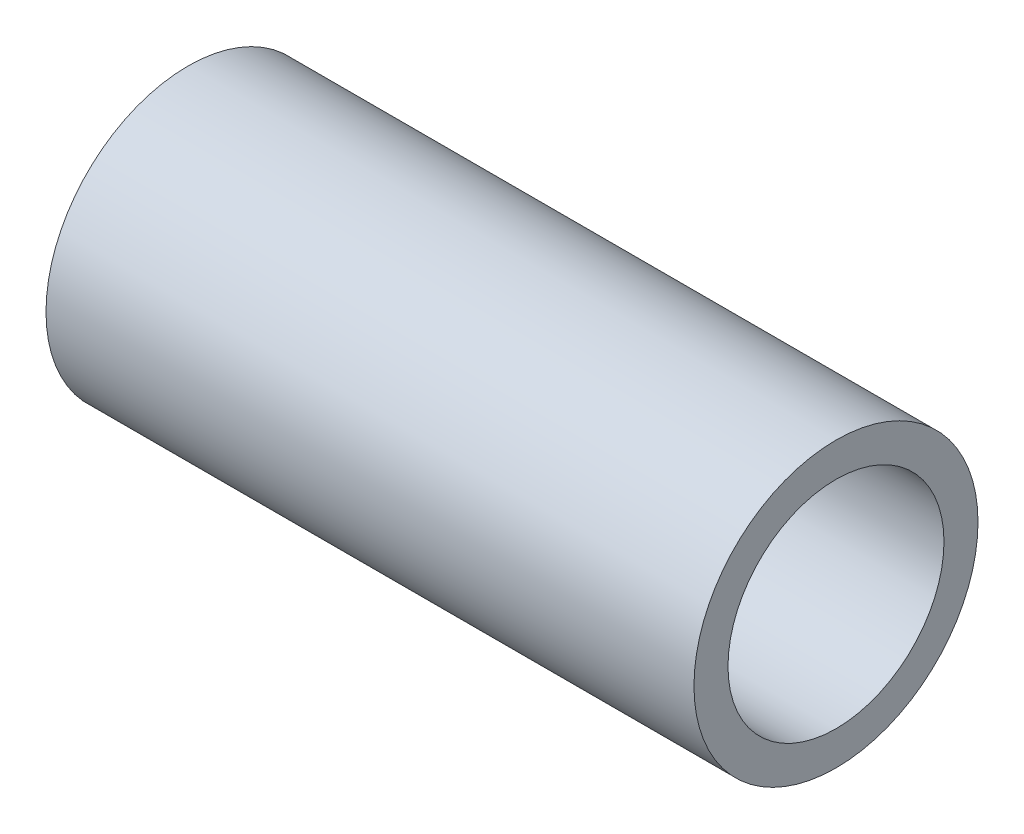
ISO-10303-21;
HEADER;
FILE_DESCRIPTION(('STEP AP214'),'2;1');
FILE_NAME('part.step','',(''),(''),'','','');
FILE_SCHEMA(('AUTOMOTIVE_DESIGN { 1 0 10303 214 1 1 1 1 }'));
ENDSEC;
DATA;
#1=APPLICATION_CONTEXT('core data for automotive mechanical design processes');
#2=APPLICATION_PROTOCOL_DEFINITION('international standard','automotive_design',2000,#1);
#3=PRODUCT_CONTEXT('',#1,'mechanical');
#4=PRODUCT('Part','Part','',(#3));
#5=PRODUCT_RELATED_PRODUCT_CATEGORY('part','',(#4));
#6=PRODUCT_DEFINITION_FORMATION('','',#4);
#7=PRODUCT_DEFINITION_CONTEXT('part definition',#1,'design');
#8=PRODUCT_DEFINITION('design','',#6,#7);
#9=PRODUCT_DEFINITION_SHAPE('','',#8);
#10=(LENGTH_UNIT() NAMED_UNIT(*) SI_UNIT(.MILLI.,.METRE.));
#11=(NAMED_UNIT(*) PLANE_ANGLE_UNIT() SI_UNIT($,.RADIAN.));
#12=(NAMED_UNIT(*) SI_UNIT($,.STERADIAN.) SOLID_ANGLE_UNIT());
#13=UNCERTAINTY_MEASURE_WITH_UNIT(LENGTH_MEASURE(1.E-05),#10,'distance_accuracy_value','');
#14=(GEOMETRIC_REPRESENTATION_CONTEXT(3) GLOBAL_UNCERTAINTY_ASSIGNED_CONTEXT((#13)) GLOBAL_UNIT_ASSIGNED_CONTEXT((#10,
#11,#12)) REPRESENTATION_CONTEXT('',''));
#15=CARTESIAN_POINT('',(0.,0.,0.));
#16=DIRECTION('',(0.,0.,1.));
#17=DIRECTION('',(1.,0.,0.));
#18=AXIS2_PLACEMENT_3D('',#15,#16,#17);
#19=CARTESIAN_POINT('',(76.2,0.,0.));
#20=DIRECTION('',(1.,0.,0.));
#21=DIRECTION('',(0.,0.,-1.));
#22=AXIS2_PLACEMENT_3D('',#19,#20,#21);
#23=PLANE('',#22);
#24=CARTESIAN_POINT('',(76.2,0.,0.));
#25=DIRECTION('',(1.,0.,0.));
#26=DIRECTION('',(0.,0.,-1.));
#27=AXIS2_PLACEMENT_3D('',#24,#25,#26);
#28=CIRCLE('',#27,16.7005);
#29=CARTESIAN_POINT('',(76.2,0.,-16.7005));
#30=VERTEX_POINT('',#29);
#31=EDGE_CURVE('E10',#30,#30,#28,.T.);
#32=ORIENTED_EDGE('',*,*,#31,.T.);
#33=EDGE_LOOP('',(#32));
#34=FACE_BOUND('',#33,.T.);
#35=CARTESIAN_POINT('',(76.2,0.,0.));
#36=DIRECTION('',(1.,0.,0.));
#37=DIRECTION('',(0.,0.,-1.));
#38=AXIS2_PLACEMENT_3D('',#35,#36,#37);
#39=CIRCLE('',#38,12.7);
#40=CARTESIAN_POINT('',(76.2,0.,-12.7));
#41=VERTEX_POINT('',#40);
#42=EDGE_CURVE('E41',#41,#41,#39,.T.);
#43=ORIENTED_EDGE('',*,*,#42,.F.);
#44=EDGE_LOOP('',(#43));
#45=FACE_BOUND('',#44,.T.);
#46=ADVANCED_FACE('F30',(#34,#45),#23,.T.);
#47=CARTESIAN_POINT('',(0.,0.,0.));
#48=DIRECTION('',(1.,0.,0.));
#49=DIRECTION('',(0.,0.,-1.));
#50=AXIS2_PLACEMENT_3D('',#47,#48,#49);
#51=PLANE('',#50);
#52=CARTESIAN_POINT('',(0.,0.,0.));
#53=DIRECTION('',(1.,0.,0.));
#54=DIRECTION('',(0.,0.,-1.));
#55=AXIS2_PLACEMENT_3D('',#52,#53,#54);
#56=CIRCLE('',#55,16.7005);
#57=CARTESIAN_POINT('',(0.,0.,-16.7005));
#58=VERTEX_POINT('',#57);
#59=EDGE_CURVE('E34',#58,#58,#56,.T.);
#60=ORIENTED_EDGE('',*,*,#59,.F.);
#61=EDGE_LOOP('',(#60));
#62=FACE_BOUND('',#61,.T.);
#63=CARTESIAN_POINT('',(0.,0.,0.));
#64=DIRECTION('',(1.,0.,0.));
#65=DIRECTION('',(0.,0.,-1.));
#66=AXIS2_PLACEMENT_3D('',#63,#64,#65);
#67=CIRCLE('',#66,12.7);
#68=CARTESIAN_POINT('',(0.,0.,-12.7));
#69=VERTEX_POINT('',#68);
#70=EDGE_CURVE('E43',#69,#69,#67,.T.);
#71=ORIENTED_EDGE('',*,*,#70,.T.);
#72=EDGE_LOOP('',(#71));
#73=FACE_BOUND('',#72,.T.);
#74=ADVANCED_FACE('F53',(#62,#73),#51,.F.);
#75=CARTESIAN_POINT('',(76.2,0.,0.));
#76=DIRECTION('',(-1.,0.,0.));
#77=DIRECTION('',(0.,0.,1.));
#78=AXIS2_PLACEMENT_3D('',#75,#76,#77);
#79=CYLINDRICAL_SURFACE('',#78,16.7005);
#80=ORIENTED_EDGE('',*,*,#31,.F.);
#81=EDGE_LOOP('',(#80));
#82=FACE_BOUND('',#81,.T.);
#83=ORIENTED_EDGE('',*,*,#59,.T.);
#84=EDGE_LOOP('',(#83));
#85=FACE_BOUND('',#84,.T.);
#86=ADVANCED_FACE('F32',(#82,#85),#79,.T.);
#87=CARTESIAN_POINT('',(76.2,0.,0.));
#88=DIRECTION('',(-1.,0.,0.));
#89=DIRECTION('',(0.,0.,1.));
#90=AXIS2_PLACEMENT_3D('',#87,#88,#89);
#91=CYLINDRICAL_SURFACE('',#90,12.7);
#92=ORIENTED_EDGE('',*,*,#42,.T.);
#93=EDGE_LOOP('',(#92));
#94=FACE_BOUND('',#93,.T.);
#95=ORIENTED_EDGE('',*,*,#70,.F.);
#96=EDGE_LOOP('',(#95));
#97=FACE_BOUND('',#96,.T.);
#98=ADVANCED_FACE('F49',(#94,#97),#91,.F.);
#99=CLOSED_SHELL('',(#46,#74,#86,#98));
#100=MANIFOLD_SOLID_BREP('B2',#99);
#101=ADVANCED_BREP_SHAPE_REPRESENTATION('',(#18,#100),#14);
#102=SHAPE_DEFINITION_REPRESENTATION(#9,#101);
ENDSEC;
END-ISO-10303-21;
